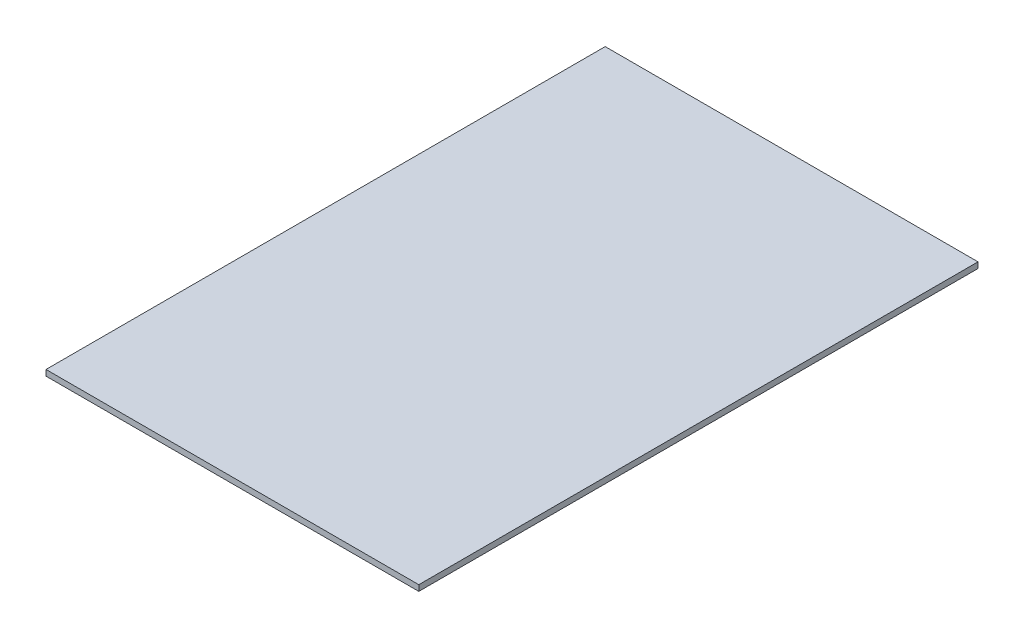
ISO-10303-21;
HEADER;
FILE_DESCRIPTION(('STEP AP214'),'2;1');
FILE_NAME('part.step','',(''),(''),'','','');
FILE_SCHEMA(('AUTOMOTIVE_DESIGN { 1 0 10303 214 1 1 1 1 }'));
ENDSEC;
DATA;
#1=APPLICATION_CONTEXT('core data for automotive mechanical design processes');
#2=APPLICATION_PROTOCOL_DEFINITION('international standard','automotive_design',2000,#1);
#3=PRODUCT_CONTEXT('',#1,'mechanical');
#4=PRODUCT('Part','Part','',(#3));
#5=PRODUCT_RELATED_PRODUCT_CATEGORY('part','',(#4));
#6=PRODUCT_DEFINITION_FORMATION('','',#4);
#7=PRODUCT_DEFINITION_CONTEXT('part definition',#1,'design');
#8=PRODUCT_DEFINITION('design','',#6,#7);
#9=PRODUCT_DEFINITION_SHAPE('','',#8);
#10=(LENGTH_UNIT() NAMED_UNIT(*) SI_UNIT(.MILLI.,.METRE.));
#11=(NAMED_UNIT(*) PLANE_ANGLE_UNIT() SI_UNIT($,.RADIAN.));
#12=(NAMED_UNIT(*) SI_UNIT($,.STERADIAN.) SOLID_ANGLE_UNIT());
#13=UNCERTAINTY_MEASURE_WITH_UNIT(LENGTH_MEASURE(1.E-05),#10,'distance_accuracy_value','');
#14=(GEOMETRIC_REPRESENTATION_CONTEXT(3) GLOBAL_UNCERTAINTY_ASSIGNED_CONTEXT((#13)) GLOBAL_UNIT_ASSIGNED_CONTEXT((#10,
#11,#12)) REPRESENTATION_CONTEXT('',''));
#15=CARTESIAN_POINT('',(0.,0.,0.));
#16=DIRECTION('',(0.,0.,1.));
#17=DIRECTION('',(1.,0.,0.));
#18=AXIS2_PLACEMENT_3D('',#15,#16,#17);
#19=CARTESIAN_POINT('',(609.6,-19.05,914.4));
#20=DIRECTION('',(1.,0.,0.));
#21=DIRECTION('',(0.,0.,-1.));
#22=AXIS2_PLACEMENT_3D('',#19,#20,#21);
#23=PLANE('',#22);
#24=DIRECTION('',(0.,0.,-1.));
#25=VECTOR('',#24,1.);
#26=CARTESIAN_POINT('',(609.6,0.,914.4));
#27=LINE('',#26,#25);
#28=CARTESIAN_POINT('',(609.6,0.,914.4));
#29=VERTEX_POINT('',#28);
#30=CARTESIAN_POINT('',(609.6,0.,-914.4));
#31=VERTEX_POINT('',#30);
#32=EDGE_CURVE('E105',#29,#31,#27,.T.);
#33=ORIENTED_EDGE('',*,*,#32,.F.);
#34=DIRECTION('',(0.,1.,0.));
#35=VECTOR('',#34,1.);
#36=CARTESIAN_POINT('',(609.6,-19.05,914.4));
#37=LINE('',#36,#35);
#38=CARTESIAN_POINT('',(609.6,-19.05,914.4));
#39=VERTEX_POINT('',#38);
#40=EDGE_CURVE('E11',#39,#29,#37,.T.);
#41=ORIENTED_EDGE('',*,*,#40,.F.);
#42=DIRECTION('',(0.,0.,-1.));
#43=VECTOR('',#42,1.);
#44=CARTESIAN_POINT('',(609.6,-19.05,914.4));
#45=LINE('',#44,#43);
#46=CARTESIAN_POINT('',(609.6,-19.05,-914.4));
#47=VERTEX_POINT('',#46);
#48=EDGE_CURVE('E99',#39,#47,#45,.T.);
#49=ORIENTED_EDGE('',*,*,#48,.T.);
#50=DIRECTION('',(0.,1.,0.));
#51=VECTOR('',#50,1.);
#52=CARTESIAN_POINT('',(609.6,-19.05,-914.4));
#53=LINE('',#52,#51);
#54=EDGE_CURVE('E44',#47,#31,#53,.T.);
#55=ORIENTED_EDGE('',*,*,#54,.T.);
#56=EDGE_LOOP('',(#33,#41,#49,#55));
#57=FACE_BOUND('',#56,.T.);
#58=ADVANCED_FACE('F41',(#57),#23,.T.);
#59=CARTESIAN_POINT('',(-609.6,-19.05,914.4));
#60=DIRECTION('',(0.,0.,1.));
#61=DIRECTION('',(1.,0.,0.));
#62=AXIS2_PLACEMENT_3D('',#59,#60,#61);
#63=PLANE('',#62);
#64=DIRECTION('',(1.,0.,0.));
#65=VECTOR('',#64,1.);
#66=CARTESIAN_POINT('',(-609.6,0.,914.4));
#67=LINE('',#66,#65);
#68=CARTESIAN_POINT('',(-609.6,0.,914.4));
#69=VERTEX_POINT('',#68);
#70=EDGE_CURVE('E101',#69,#29,#67,.T.);
#71=ORIENTED_EDGE('',*,*,#70,.F.);
#72=DIRECTION('',(0.,1.,0.));
#73=VECTOR('',#72,1.);
#74=CARTESIAN_POINT('',(-609.6,-19.05,914.4));
#75=LINE('',#74,#73);
#76=CARTESIAN_POINT('',(-609.6,-19.05,914.4));
#77=VERTEX_POINT('',#76);
#78=EDGE_CURVE('E50',#77,#69,#75,.T.);
#79=ORIENTED_EDGE('',*,*,#78,.F.);
#80=DIRECTION('',(1.,0.,0.));
#81=VECTOR('',#80,1.);
#82=CARTESIAN_POINT('',(-609.6,-19.05,914.4));
#83=LINE('',#82,#81);
#84=EDGE_CURVE('E96',#77,#39,#83,.T.);
#85=ORIENTED_EDGE('',*,*,#84,.T.);
#86=ORIENTED_EDGE('',*,*,#40,.T.);
#87=EDGE_LOOP('',(#71,#79,#85,#86));
#88=FACE_BOUND('',#87,.T.);
#89=ADVANCED_FACE('F115',(#88),#63,.T.);
#90=CARTESIAN_POINT('',(-609.6,-19.05,914.4));
#91=DIRECTION('',(-1.,0.,0.));
#92=DIRECTION('',(0.,0.,1.));
#93=AXIS2_PLACEMENT_3D('',#90,#91,#92);
#94=PLANE('',#93);
#95=DIRECTION('',(0.,0.,1.));
#96=VECTOR('',#95,1.);
#97=CARTESIAN_POINT('',(-609.6,0.,914.4));
#98=LINE('',#97,#96);
#99=CARTESIAN_POINT('',(-609.6,0.,-914.4));
#100=VERTEX_POINT('',#99);
#101=EDGE_CURVE('E91',#100,#69,#98,.T.);
#102=ORIENTED_EDGE('',*,*,#101,.F.);
#103=DIRECTION('',(0.,1.,0.));
#104=VECTOR('',#103,1.);
#105=CARTESIAN_POINT('',(-609.6,-19.05,-914.4));
#106=LINE('',#105,#104);
#107=CARTESIAN_POINT('',(-609.6,-19.05,-914.4));
#108=VERTEX_POINT('',#107);
#109=EDGE_CURVE('E86',#108,#100,#106,.T.);
#110=ORIENTED_EDGE('',*,*,#109,.F.);
#111=DIRECTION('',(0.,0.,1.));
#112=VECTOR('',#111,1.);
#113=CARTESIAN_POINT('',(-609.6,-19.05,914.4));
#114=LINE('',#113,#112);
#115=EDGE_CURVE('E89',#108,#77,#114,.T.);
#116=ORIENTED_EDGE('',*,*,#115,.T.);
#117=ORIENTED_EDGE('',*,*,#78,.T.);
#118=EDGE_LOOP('',(#102,#110,#116,#117));
#119=FACE_BOUND('',#118,.T.);
#120=ADVANCED_FACE('F88',(#119),#94,.T.);
#121=CARTESIAN_POINT('',(-609.6,-19.05,-914.4));
#122=DIRECTION('',(0.,0.,-1.));
#123=DIRECTION('',(-1.,0.,0.));
#124=AXIS2_PLACEMENT_3D('',#121,#122,#123);
#125=PLANE('',#124);
#126=DIRECTION('',(-1.,0.,0.));
#127=VECTOR('',#126,1.);
#128=CARTESIAN_POINT('',(-609.6,0.,-914.4));
#129=LINE('',#128,#127);
#130=EDGE_CURVE('E108',#31,#100,#129,.T.);
#131=ORIENTED_EDGE('',*,*,#130,.F.);
#132=ORIENTED_EDGE('',*,*,#54,.F.);
#133=DIRECTION('',(-1.,0.,0.));
#134=VECTOR('',#133,1.);
#135=CARTESIAN_POINT('',(-609.6,-19.05,-914.4));
#136=LINE('',#135,#134);
#137=EDGE_CURVE('E95',#47,#108,#136,.T.);
#138=ORIENTED_EDGE('',*,*,#137,.T.);
#139=ORIENTED_EDGE('',*,*,#109,.T.);
#140=EDGE_LOOP('',(#131,#132,#138,#139));
#141=FACE_BOUND('',#140,.T.);
#142=ADVANCED_FACE('F98',(#141),#125,.T.);
#143=CARTESIAN_POINT('',(0.,-19.05,0.));
#144=DIRECTION('',(0.,-1.,0.));
#145=DIRECTION('',(0.,0.,-1.));
#146=AXIS2_PLACEMENT_3D('',#143,#144,#145);
#147=PLANE('',#146);
#148=ORIENTED_EDGE('',*,*,#48,.F.);
#149=ORIENTED_EDGE('',*,*,#84,.F.);
#150=ORIENTED_EDGE('',*,*,#115,.F.);
#151=ORIENTED_EDGE('',*,*,#137,.F.);
#152=EDGE_LOOP('',(#148,#149,#150,#151));
#153=FACE_BOUND('',#152,.T.);
#154=ADVANCED_FACE('F94',(#153),#147,.T.);
#155=CARTESIAN_POINT('',(0.,0.,0.));
#156=DIRECTION('',(0.,-1.,0.));
#157=DIRECTION('',(0.,0.,-1.));
#158=AXIS2_PLACEMENT_3D('',#155,#156,#157);
#159=PLANE('',#158);
#160=ORIENTED_EDGE('',*,*,#32,.T.);
#161=ORIENTED_EDGE('',*,*,#130,.T.);
#162=ORIENTED_EDGE('',*,*,#101,.T.);
#163=ORIENTED_EDGE('',*,*,#70,.T.);
#164=EDGE_LOOP('',(#160,#161,#162,#163));
#165=FACE_BOUND('',#164,.T.);
#166=ADVANCED_FACE('F114',(#165),#159,.F.);
#167=CLOSED_SHELL('',(#58,#89,#120,#142,#154,#166));
#168=MANIFOLD_SOLID_BREP('B2',#167);
#169=ADVANCED_BREP_SHAPE_REPRESENTATION('',(#18,#168),#14);
#170=SHAPE_DEFINITION_REPRESENTATION(#9,#169);
ENDSEC;
END-ISO-10303-21;
